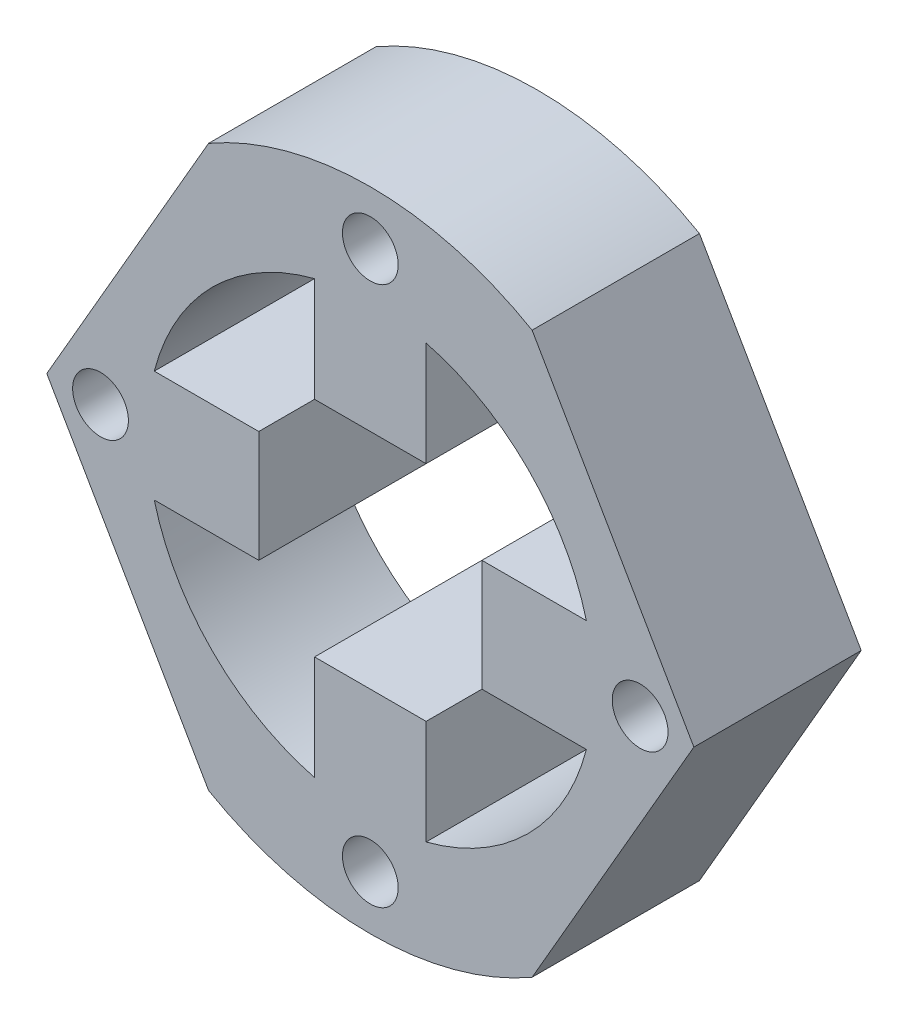
ISO-10303-21;
HEADER;
FILE_DESCRIPTION(('STEP AP214'),'2;1');
FILE_NAME('part.step','',(''),(''),'','','');
FILE_SCHEMA(('AUTOMOTIVE_DESIGN { 1 0 10303 214 1 1 1 1 }'));
ENDSEC;
DATA;
#1=APPLICATION_CONTEXT('core data for automotive mechanical design processes');
#2=APPLICATION_PROTOCOL_DEFINITION('international standard','automotive_design',2000,#1);
#3=PRODUCT_CONTEXT('',#1,'mechanical');
#4=PRODUCT('Part','Part','',(#3));
#5=PRODUCT_RELATED_PRODUCT_CATEGORY('part','',(#4));
#6=PRODUCT_DEFINITION_FORMATION('','',#4);
#7=PRODUCT_DEFINITION_CONTEXT('part definition',#1,'design');
#8=PRODUCT_DEFINITION('design','',#6,#7);
#9=PRODUCT_DEFINITION_SHAPE('','',#8);
#10=(LENGTH_UNIT() NAMED_UNIT(*) SI_UNIT(.MILLI.,.METRE.));
#11=(NAMED_UNIT(*) PLANE_ANGLE_UNIT() SI_UNIT($,.RADIAN.));
#12=(NAMED_UNIT(*) SI_UNIT($,.STERADIAN.) SOLID_ANGLE_UNIT());
#13=UNCERTAINTY_MEASURE_WITH_UNIT(LENGTH_MEASURE(1.E-05),#10,'distance_accuracy_value','');
#14=(GEOMETRIC_REPRESENTATION_CONTEXT(3) GLOBAL_UNCERTAINTY_ASSIGNED_CONTEXT((#13)) GLOBAL_UNIT_ASSIGNED_CONTEXT((#10,
#11,#12)) REPRESENTATION_CONTEXT('',''));
#15=CARTESIAN_POINT('',(0.,0.,0.));
#16=DIRECTION('',(0.,0.,1.));
#17=DIRECTION('',(1.,0.,0.));
#18=AXIS2_PLACEMENT_3D('',#15,#16,#17);
#19=CARTESIAN_POINT('',(0.,0.,-15.));
#20=DIRECTION('',(0.,0.,1.));
#21=DIRECTION('',(1.,0.,0.));
#22=AXIS2_PLACEMENT_3D('',#19,#20,#21);
#23=CYLINDRICAL_SURFACE('',#22,29.);
#24=CARTESIAN_POINT('',(0.,0.,-15.));
#25=DIRECTION('',(0.,0.,1.));
#26=DIRECTION('',(1.,0.,0.));
#27=AXIS2_PLACEMENT_3D('',#24,#25,#26);
#28=CIRCLE('',#27,29.);
#29=CARTESIAN_POINT('',(-14.5000000000003,-25.1147367097486,-15.));
#30=VERTEX_POINT('',#29);
#31=CARTESIAN_POINT('',(14.4999999999998,-25.1147367097489,-15.));
#32=VERTEX_POINT('',#31);
#33=EDGE_CURVE('E204',#30,#32,#28,.T.);
#34=ORIENTED_EDGE('',*,*,#33,.T.);
#35=DIRECTION('',(0.,0.,-1.));
#36=VECTOR('',#35,1.);
#37=CARTESIAN_POINT('',(14.4999999999998,-25.1147367097489,12.));
#38=LINE('',#37,#36);
#39=CARTESIAN_POINT('',(14.4999999999998,-25.1147367097489,0.));
#40=VERTEX_POINT('',#39);
#41=EDGE_CURVE('E187',#40,#32,#38,.T.);
#42=ORIENTED_EDGE('',*,*,#41,.F.);
#43=CARTESIAN_POINT('',(0.,0.,0.));
#44=DIRECTION('',(0.,0.,1.));
#45=DIRECTION('',(1.,0.,0.));
#46=AXIS2_PLACEMENT_3D('',#43,#44,#45);
#47=CIRCLE('',#46,29.);
#48=CARTESIAN_POINT('',(-14.5000000000003,-25.1147367097486,0.));
#49=VERTEX_POINT('',#48);
#50=EDGE_CURVE('E215',#49,#40,#47,.T.);
#51=ORIENTED_EDGE('',*,*,#50,.F.);
#52=DIRECTION('',(0.,0.,-1.));
#53=VECTOR('',#52,1.);
#54=CARTESIAN_POINT('',(-14.5000000000003,-25.1147367097486,12.));
#55=LINE('',#54,#53);
#56=EDGE_CURVE('E207',#49,#30,#55,.T.);
#57=ORIENTED_EDGE('',*,*,#56,.T.);
#58=EDGE_LOOP('',(#34,#42,#51,#57));
#59=FACE_BOUND('',#58,.T.);
#60=ADVANCED_FACE('F39',(#59),#23,.T.);
#61=CARTESIAN_POINT('',(0.,0.,-15.));
#62=DIRECTION('',(0.,0.,1.));
#63=DIRECTION('',(1.,0.,0.));
#64=AXIS2_PLACEMENT_3D('',#61,#62,#63);
#65=PLANE('',#64);
#66=CARTESIAN_POINT('',(0.,0.,-15.));
#67=DIRECTION('',(0.,0.,1.));
#68=DIRECTION('',(1.,0.,0.));
#69=AXIS2_PLACEMENT_3D('',#66,#67,#68);
#70=CIRCLE('',#69,20.);
#71=CARTESIAN_POINT('',(19.3649167310371,5.,-15.));
#72=VERTEX_POINT('',#71);
#73=CARTESIAN_POINT('',(5.,19.3649167310371,-15.));
#74=VERTEX_POINT('',#73);
#75=EDGE_CURVE('E221',#72,#74,#70,.T.);
#76=ORIENTED_EDGE('',*,*,#75,.T.);
#77=DIRECTION('',(0.,-1.,0.));
#78=VECTOR('',#77,1.);
#79=CARTESIAN_POINT('',(4.99999999999994,0.,-15.));
#80=LINE('',#79,#78);
#81=CARTESIAN_POINT('',(4.99999999999997,9.99999673103708,-15.));
#82=VERTEX_POINT('',#81);
#83=EDGE_CURVE('E320',#74,#82,#80,.T.);
#84=ORIENTED_EDGE('',*,*,#83,.T.);
#85=DIRECTION('',(1.,0.,0.));
#86=VECTOR('',#85,1.);
#87=CARTESIAN_POINT('',(0.,9.99999673103708,-15.));
#88=LINE('',#87,#86);
#89=CARTESIAN_POINT('',(-5.,9.99999673103708,-15.));
#90=VERTEX_POINT('',#89);
#91=EDGE_CURVE('E326',#90,#82,#88,.T.);
#92=ORIENTED_EDGE('',*,*,#91,.F.);
#93=DIRECTION('',(0.,-1.,0.));
#94=VECTOR('',#93,1.);
#95=CARTESIAN_POINT('',(-5.,0.,-15.));
#96=LINE('',#95,#94);
#97=CARTESIAN_POINT('',(-5.,19.3649167310371,-15.));
#98=VERTEX_POINT('',#97);
#99=EDGE_CURVE('E322',#98,#90,#96,.T.);
#100=ORIENTED_EDGE('',*,*,#99,.F.);
#101=CARTESIAN_POINT('',(-19.3649167310371,5.,-15.));
#102=VERTEX_POINT('',#101);
#103=EDGE_CURVE('E374',#98,#102,#70,.T.);
#104=ORIENTED_EDGE('',*,*,#103,.T.);
#105=DIRECTION('',(1.,0.,0.));
#106=VECTOR('',#105,1.);
#107=CARTESIAN_POINT('',(0.,5.00000000000001,-15.));
#108=LINE('',#107,#106);
#109=CARTESIAN_POINT('',(-9.99999673103708,5.,-15.));
#110=VERTEX_POINT('',#109);
#111=EDGE_CURVE('E300',#102,#110,#108,.T.);
#112=ORIENTED_EDGE('',*,*,#111,.T.);
#113=DIRECTION('',(0.,-1.,0.));
#114=VECTOR('',#113,1.);
#115=CARTESIAN_POINT('',(-9.99999673103708,0.,-15.));
#116=LINE('',#115,#114);
#117=CARTESIAN_POINT('',(-9.99999673103708,-5.,-15.));
#118=VERTEX_POINT('',#117);
#119=EDGE_CURVE('E297',#110,#118,#116,.T.);
#120=ORIENTED_EDGE('',*,*,#119,.T.);
#121=DIRECTION('',(1.,0.,0.));
#122=VECTOR('',#121,1.);
#123=CARTESIAN_POINT('',(0.,-5.,-15.));
#124=LINE('',#123,#122);
#125=CARTESIAN_POINT('',(-19.3649167310371,-5.,-15.));
#126=VERTEX_POINT('',#125);
#127=EDGE_CURVE('E294',#126,#118,#124,.T.);
#128=ORIENTED_EDGE('',*,*,#127,.F.);
#129=CARTESIAN_POINT('',(-5.,-19.3649167310371,-15.));
#130=VERTEX_POINT('',#129);
#131=EDGE_CURVE('E380',#126,#130,#70,.T.);
#132=ORIENTED_EDGE('',*,*,#131,.T.);
#133=DIRECTION('',(0.,1.,0.));
#134=VECTOR('',#133,1.);
#135=CARTESIAN_POINT('',(-5.,0.,-15.));
#136=LINE('',#135,#134);
#137=CARTESIAN_POINT('',(-5.,-9.99999673103708,-15.));
#138=VERTEX_POINT('',#137);
#139=EDGE_CURVE('E266',#130,#138,#136,.T.);
#140=ORIENTED_EDGE('',*,*,#139,.T.);
#141=DIRECTION('',(1.,0.,0.));
#142=VECTOR('',#141,1.);
#143=CARTESIAN_POINT('',(0.,-9.99999673103708,-15.));
#144=LINE('',#143,#142);
#145=CARTESIAN_POINT('',(5.,-9.99999673103708,-15.));
#146=VERTEX_POINT('',#145);
#147=EDGE_CURVE('E273',#138,#146,#144,.T.);
#148=ORIENTED_EDGE('',*,*,#147,.T.);
#149=DIRECTION('',(0.,1.,0.));
#150=VECTOR('',#149,1.);
#151=CARTESIAN_POINT('',(4.99999999999999,0.,-15.));
#152=LINE('',#151,#150);
#153=CARTESIAN_POINT('',(5.,-19.3649167310371,-15.));
#154=VERTEX_POINT('',#153);
#155=EDGE_CURVE('E269',#154,#146,#152,.T.);
#156=ORIENTED_EDGE('',*,*,#155,.F.);
#157=CARTESIAN_POINT('',(19.3649167310371,-5.,-15.));
#158=VERTEX_POINT('',#157);
#159=EDGE_CURVE('E375',#154,#158,#70,.T.);
#160=ORIENTED_EDGE('',*,*,#159,.T.);
#161=DIRECTION('',(-1.,0.,0.));
#162=VECTOR('',#161,1.);
#163=CARTESIAN_POINT('',(0.,-5.00000000000002,-15.));
#164=LINE('',#163,#162);
#165=CARTESIAN_POINT('',(9.99999673103709,-5.00000000000001,-15.));
#166=VERTEX_POINT('',#165);
#167=EDGE_CURVE('E347',#158,#166,#164,.T.);
#168=ORIENTED_EDGE('',*,*,#167,.T.);
#169=DIRECTION('',(0.,-1.,0.));
#170=VECTOR('',#169,1.);
#171=CARTESIAN_POINT('',(9.99999673103709,0.,-15.));
#172=LINE('',#171,#170);
#173=CARTESIAN_POINT('',(9.99999673103709,5.00000000000001,-15.));
#174=VERTEX_POINT('',#173);
#175=EDGE_CURVE('E353',#174,#166,#172,.T.);
#176=ORIENTED_EDGE('',*,*,#175,.F.);
#177=DIRECTION('',(-1.,0.,0.));
#178=VECTOR('',#177,1.);
#179=CARTESIAN_POINT('',(0.,5.00000000000002,-15.));
#180=LINE('',#179,#178);
#181=EDGE_CURVE('E349',#72,#174,#180,.T.);
#182=ORIENTED_EDGE('',*,*,#181,.F.);
#183=EDGE_LOOP('',(#76,#84,#92,#100,#104,#112,#120,#128,#132,#140,#148,#156,#160,#168,#176,#182));
#184=FACE_BOUND('',#183,.T.);
#185=CARTESIAN_POINT('',(-24.1824583655185,0.,-15.));
#186=DIRECTION('',(0.,0.,1.));
#187=DIRECTION('',(1.,0.,0.));
#188=AXIS2_PLACEMENT_3D('',#185,#186,#187);
#189=CIRCLE('',#188,2.5);
#190=CARTESIAN_POINT('',(-21.6824583655186,0.,-15.));
#191=VERTEX_POINT('',#190);
#192=EDGE_CURVE('E225',#191,#191,#189,.F.);
#193=ORIENTED_EDGE('',*,*,#192,.F.);
#194=EDGE_LOOP('',(#193));
#195=FACE_BOUND('',#194,.T.);
#196=CARTESIAN_POINT('',(0.,-24.1824583655185,-15.));
#197=DIRECTION('',(0.,0.,1.));
#198=DIRECTION('',(1.,0.,0.));
#199=AXIS2_PLACEMENT_3D('',#196,#197,#198);
#200=CIRCLE('',#199,2.5);
#201=CARTESIAN_POINT('',(2.5,-24.1824583655185,-15.));
#202=VERTEX_POINT('',#201);
#203=EDGE_CURVE('E230',#202,#202,#200,.F.);
#204=ORIENTED_EDGE('',*,*,#203,.F.);
#205=EDGE_LOOP('',(#204));
#206=FACE_BOUND('',#205,.T.);
#207=CARTESIAN_POINT('',(24.1824583655185,0.,-15.));
#208=DIRECTION('',(0.,0.,1.));
#209=DIRECTION('',(1.,0.,0.));
#210=AXIS2_PLACEMENT_3D('',#207,#208,#209);
#211=CIRCLE('',#210,2.5);
#212=CARTESIAN_POINT('',(26.6824583655185,0.,-15.));
#213=VERTEX_POINT('',#212);
#214=EDGE_CURVE('E234',#213,#213,#211,.F.);
#215=ORIENTED_EDGE('',*,*,#214,.F.);
#216=EDGE_LOOP('',(#215));
#217=FACE_BOUND('',#216,.T.);
#218=CARTESIAN_POINT('',(0.,24.1824583655185,-15.));
#219=DIRECTION('',(0.,0.,1.));
#220=DIRECTION('',(1.,0.,0.));
#221=AXIS2_PLACEMENT_3D('',#218,#219,#220);
#222=CIRCLE('',#221,2.5);
#223=CARTESIAN_POINT('',(2.5,24.1824583655185,-15.));
#224=VERTEX_POINT('',#223);
#225=EDGE_CURVE('E237',#224,#224,#222,.F.);
#226=ORIENTED_EDGE('',*,*,#225,.F.);
#227=EDGE_LOOP('',(#226));
#228=FACE_BOUND('',#227,.T.);
#229=DIRECTION('',(-0.500000000000007,-0.866025403784435,0.));
#230=VECTOR('',#229,1.);
#231=CARTESIAN_POINT('',(21.7499999999999,-12.5573683548745,-15.));
#232=LINE('',#231,#230);
#233=CARTESIAN_POINT('',(29.,-1.97758476261356E-13,-15.));
#234=VERTEX_POINT('',#233);
#235=EDGE_CURVE('E190',#234,#32,#232,.T.);
#236=ORIENTED_EDGE('',*,*,#235,.T.);
#237=ORIENTED_EDGE('',*,*,#33,.F.);
#238=DIRECTION('',(-0.499999999999995,0.866025403784442,0.));
#239=VECTOR('',#238,1.);
#240=CARTESIAN_POINT('',(-21.7500000000001,-12.5573683548743,-15.));
#241=LINE('',#240,#239);
#242=CARTESIAN_POINT('',(-29.,0.,-15.));
#243=VERTEX_POINT('',#242);
#244=EDGE_CURVE('E605',#30,#243,#241,.T.);
#245=ORIENTED_EDGE('',*,*,#244,.T.);
#246=DIRECTION('',(0.500000000000001,0.866025403784438,0.));
#247=VECTOR('',#246,1.);
#248=CARTESIAN_POINT('',(-21.75,12.5573683548744,-15.));
#249=LINE('',#248,#247);
#250=CARTESIAN_POINT('',(-14.4999999999999,25.1147367097488,-15.));
#251=VERTEX_POINT('',#250);
#252=EDGE_CURVE('E226',#243,#251,#249,.T.);
#253=ORIENTED_EDGE('',*,*,#252,.T.);
#254=CARTESIAN_POINT('',(14.5000000000001,25.1147367097487,-15.));
#255=VERTEX_POINT('',#254);
#256=EDGE_CURVE('E210',#255,#251,#28,.T.);
#257=ORIENTED_EDGE('',*,*,#256,.F.);
#258=DIRECTION('',(-0.499999999999995,0.866025403784442,0.));
#259=VECTOR('',#258,1.);
#260=CARTESIAN_POINT('',(21.7500000000001,12.5573683548742,-15.));
#261=LINE('',#260,#259);
#262=EDGE_CURVE('E206',#234,#255,#261,.T.);
#263=ORIENTED_EDGE('',*,*,#262,.F.);
#264=EDGE_LOOP('',(#236,#237,#245,#253,#257,#263));
#265=FACE_BOUND('',#264,.T.);
#266=ADVANCED_FACE('F202',(#184,#195,#206,#217,#228,#265),#65,.F.);
#267=CARTESIAN_POINT('',(0.,0.,0.));
#268=DIRECTION('',(0.,0.,1.));
#269=DIRECTION('',(1.,0.,0.));
#270=AXIS2_PLACEMENT_3D('',#267,#268,#269);
#271=PLANE('',#270);
#272=CARTESIAN_POINT('',(0.,24.1824583655185,0.));
#273=DIRECTION('',(0.,0.,1.));
#274=DIRECTION('',(1.,0.,0.));
#275=AXIS2_PLACEMENT_3D('',#272,#273,#274);
#276=CIRCLE('',#275,2.5);
#277=CARTESIAN_POINT('',(2.5,24.1824583655185,0.));
#278=VERTEX_POINT('',#277);
#279=EDGE_CURVE('E235',#278,#278,#276,.F.);
#280=ORIENTED_EDGE('',*,*,#279,.T.);
#281=EDGE_LOOP('',(#280));
#282=FACE_BOUND('',#281,.T.);
#283=CARTESIAN_POINT('',(24.1824583655185,0.,0.));
#284=DIRECTION('',(0.,0.,1.));
#285=DIRECTION('',(1.,0.,0.));
#286=AXIS2_PLACEMENT_3D('',#283,#284,#285);
#287=CIRCLE('',#286,2.5);
#288=CARTESIAN_POINT('',(26.6824583655185,0.,0.));
#289=VERTEX_POINT('',#288);
#290=EDGE_CURVE('E231',#289,#289,#287,.F.);
#291=ORIENTED_EDGE('',*,*,#290,.T.);
#292=EDGE_LOOP('',(#291));
#293=FACE_BOUND('',#292,.T.);
#294=CARTESIAN_POINT('',(0.,-24.1824583655185,0.));
#295=DIRECTION('',(0.,0.,1.));
#296=DIRECTION('',(1.,0.,0.));
#297=AXIS2_PLACEMENT_3D('',#294,#295,#296);
#298=CIRCLE('',#297,2.5);
#299=CARTESIAN_POINT('',(2.5,-24.1824583655185,0.));
#300=VERTEX_POINT('',#299);
#301=EDGE_CURVE('E227',#300,#300,#298,.F.);
#302=ORIENTED_EDGE('',*,*,#301,.T.);
#303=EDGE_LOOP('',(#302));
#304=FACE_BOUND('',#303,.T.);
#305=CARTESIAN_POINT('',(-24.1824583655185,0.,0.));
#306=DIRECTION('',(0.,0.,1.));
#307=DIRECTION('',(1.,0.,0.));
#308=AXIS2_PLACEMENT_3D('',#305,#306,#307);
#309=CIRCLE('',#308,2.5);
#310=CARTESIAN_POINT('',(-21.6824583655186,0.,0.));
#311=VERTEX_POINT('',#310);
#312=EDGE_CURVE('E222',#311,#311,#309,.F.);
#313=ORIENTED_EDGE('',*,*,#312,.T.);
#314=EDGE_LOOP('',(#313));
#315=FACE_BOUND('',#314,.T.);
#316=CARTESIAN_POINT('',(0.,0.,0.));
#317=DIRECTION('',(0.,0.,1.));
#318=DIRECTION('',(1.,0.,0.));
#319=AXIS2_PLACEMENT_3D('',#316,#317,#318);
#320=CIRCLE('',#319,20.);
#321=CARTESIAN_POINT('',(19.3649167310371,5.,0.));
#322=VERTEX_POINT('',#321);
#323=CARTESIAN_POINT('',(5.,19.3649167310371,0.));
#324=VERTEX_POINT('',#323);
#325=EDGE_CURVE('E218',#322,#324,#320,.T.);
#326=ORIENTED_EDGE('',*,*,#325,.F.);
#327=DIRECTION('',(-1.,0.,0.));
#328=VECTOR('',#327,1.);
#329=CARTESIAN_POINT('',(0.,5.00000000000002,0.));
#330=LINE('',#329,#328);
#331=CARTESIAN_POINT('',(9.99999673103709,5.00000000000001,0.));
#332=VERTEX_POINT('',#331);
#333=EDGE_CURVE('E359',#322,#332,#330,.T.);
#334=ORIENTED_EDGE('',*,*,#333,.T.);
#335=DIRECTION('',(0.,-1.,0.));
#336=VECTOR('',#335,1.);
#337=CARTESIAN_POINT('',(9.99999673103709,0.,0.));
#338=LINE('',#337,#336);
#339=CARTESIAN_POINT('',(9.99999673103709,-5.00000000000001,0.));
#340=VERTEX_POINT('',#339);
#341=EDGE_CURVE('E350',#332,#340,#338,.T.);
#342=ORIENTED_EDGE('',*,*,#341,.T.);
#343=DIRECTION('',(-1.,0.,0.));
#344=VECTOR('',#343,1.);
#345=CARTESIAN_POINT('',(0.,-5.00000000000002,0.));
#346=LINE('',#345,#344);
#347=CARTESIAN_POINT('',(19.3649167310371,-5.,0.));
#348=VERTEX_POINT('',#347);
#349=EDGE_CURVE('E339',#348,#340,#346,.T.);
#350=ORIENTED_EDGE('',*,*,#349,.F.);
#351=CARTESIAN_POINT('',(5.,-19.3649167310371,0.));
#352=VERTEX_POINT('',#351);
#353=EDGE_CURVE('E366',#352,#348,#320,.T.);
#354=ORIENTED_EDGE('',*,*,#353,.F.);
#355=DIRECTION('',(0.,1.,0.));
#356=VECTOR('',#355,1.);
#357=CARTESIAN_POINT('',(4.99999999999999,0.,0.));
#358=LINE('',#357,#356);
#359=CARTESIAN_POINT('',(5.,-9.99999673103708,0.));
#360=VERTEX_POINT('',#359);
#361=EDGE_CURVE('E278',#352,#360,#358,.T.);
#362=ORIENTED_EDGE('',*,*,#361,.T.);
#363=DIRECTION('',(1.,0.,0.));
#364=VECTOR('',#363,1.);
#365=CARTESIAN_POINT('',(0.,-9.99999673103708,0.));
#366=LINE('',#365,#364);
#367=CARTESIAN_POINT('',(-5.,-9.99999673103708,0.));
#368=VERTEX_POINT('',#367);
#369=EDGE_CURVE('E270',#368,#360,#366,.T.);
#370=ORIENTED_EDGE('',*,*,#369,.F.);
#371=DIRECTION('',(0.,1.,0.));
#372=VECTOR('',#371,1.);
#373=CARTESIAN_POINT('',(-5.,0.,0.));
#374=LINE('',#373,#372);
#375=CARTESIAN_POINT('',(-5.,-19.3649167310371,0.));
#376=VERTEX_POINT('',#375);
#377=EDGE_CURVE('E265',#376,#368,#374,.T.);
#378=ORIENTED_EDGE('',*,*,#377,.F.);
#379=CARTESIAN_POINT('',(-19.3649167310371,-5.,0.));
#380=VERTEX_POINT('',#379);
#381=EDGE_CURVE('E386',#380,#376,#320,.T.);
#382=ORIENTED_EDGE('',*,*,#381,.F.);
#383=DIRECTION('',(1.,0.,0.));
#384=VECTOR('',#383,1.);
#385=CARTESIAN_POINT('',(0.,-5.,0.));
#386=LINE('',#385,#384);
#387=CARTESIAN_POINT('',(-9.99999673103708,-5.,0.));
#388=VERTEX_POINT('',#387);
#389=EDGE_CURVE('E286',#380,#388,#386,.T.);
#390=ORIENTED_EDGE('',*,*,#389,.T.);
#391=DIRECTION('',(0.,-1.,0.));
#392=VECTOR('',#391,1.);
#393=CARTESIAN_POINT('',(-9.99999673103708,0.,0.));
#394=LINE('',#393,#392);
#395=CARTESIAN_POINT('',(-9.99999673103708,5.,0.));
#396=VERTEX_POINT('',#395);
#397=EDGE_CURVE('E305',#396,#388,#394,.T.);
#398=ORIENTED_EDGE('',*,*,#397,.F.);
#399=DIRECTION('',(1.,0.,0.));
#400=VECTOR('',#399,1.);
#401=CARTESIAN_POINT('',(0.,5.00000000000001,0.));
#402=LINE('',#401,#400);
#403=CARTESIAN_POINT('',(-19.3649167310371,5.,0.));
#404=VERTEX_POINT('',#403);
#405=EDGE_CURVE('E298',#404,#396,#402,.T.);
#406=ORIENTED_EDGE('',*,*,#405,.F.);
#407=CARTESIAN_POINT('',(-5.,19.3649167310371,0.));
#408=VERTEX_POINT('',#407);
#409=EDGE_CURVE('E384',#408,#404,#320,.T.);
#410=ORIENTED_EDGE('',*,*,#409,.F.);
#411=DIRECTION('',(0.,-1.,0.));
#412=VECTOR('',#411,1.);
#413=CARTESIAN_POINT('',(-5.,0.,0.));
#414=LINE('',#413,#412);
#415=CARTESIAN_POINT('',(-5.,9.99999673103708,0.));
#416=VERTEX_POINT('',#415);
#417=EDGE_CURVE('E332',#408,#416,#414,.T.);
#418=ORIENTED_EDGE('',*,*,#417,.T.);
#419=DIRECTION('',(1.,0.,0.));
#420=VECTOR('',#419,1.);
#421=CARTESIAN_POINT('',(0.,9.99999673103708,0.));
#422=LINE('',#421,#420);
#423=CARTESIAN_POINT('',(4.99999999999997,9.99999673103708,0.));
#424=VERTEX_POINT('',#423);
#425=EDGE_CURVE('E323',#416,#424,#422,.T.);
#426=ORIENTED_EDGE('',*,*,#425,.T.);
#427=DIRECTION('',(0.,-1.,0.));
#428=VECTOR('',#427,1.);
#429=CARTESIAN_POINT('',(4.99999999999994,0.,0.));
#430=LINE('',#429,#428);
#431=EDGE_CURVE('E312',#324,#424,#430,.T.);
#432=ORIENTED_EDGE('',*,*,#431,.F.);
#433=EDGE_LOOP('',(#326,#334,#342,#350,#354,#362,#370,#378,#382,#390,#398,#406,#410,#418,#426,#432));
#434=FACE_BOUND('',#433,.T.);
#435=ORIENTED_EDGE('',*,*,#50,.T.);
#436=DIRECTION('',(0.500000000000007,0.866025403784435,0.));
#437=VECTOR('',#436,1.);
#438=CARTESIAN_POINT('',(21.7499999999999,-12.5573683548745,0.));
#439=LINE('',#438,#437);
#440=CARTESIAN_POINT('',(29.,-1.97758476261356E-13,0.));
#441=VERTEX_POINT('',#440);
#442=EDGE_CURVE('E193',#40,#441,#439,.T.);
#443=ORIENTED_EDGE('',*,*,#442,.T.);
#444=DIRECTION('',(-0.499999999999995,0.866025403784442,0.));
#445=VECTOR('',#444,1.);
#446=CARTESIAN_POINT('',(21.7500000000001,12.5573683548742,0.));
#447=LINE('',#446,#445);
#448=CARTESIAN_POINT('',(14.5000000000001,25.1147367097487,0.));
#449=VERTEX_POINT('',#448);
#450=EDGE_CURVE('E47',#441,#449,#447,.T.);
#451=ORIENTED_EDGE('',*,*,#450,.T.);
#452=CARTESIAN_POINT('',(-14.4999999999999,25.1147367097488,0.));
#453=VERTEX_POINT('',#452);
#454=EDGE_CURVE('E211',#449,#453,#47,.T.);
#455=ORIENTED_EDGE('',*,*,#454,.T.);
#456=DIRECTION('',(0.500000000000001,0.866025403784438,0.));
#457=VECTOR('',#456,1.);
#458=CARTESIAN_POINT('',(-21.75,12.5573683548744,0.));
#459=LINE('',#458,#457);
#460=CARTESIAN_POINT('',(-29.,0.,0.));
#461=VERTEX_POINT('',#460);
#462=EDGE_CURVE('E11',#461,#453,#459,.T.);
#463=ORIENTED_EDGE('',*,*,#462,.F.);
#464=DIRECTION('',(0.499999999999995,-0.866025403784441,0.));
#465=VECTOR('',#464,1.);
#466=CARTESIAN_POINT('',(-21.7500000000001,-12.5573683548743,0.));
#467=LINE('',#466,#465);
#468=EDGE_CURVE('E54',#461,#49,#467,.T.);
#469=ORIENTED_EDGE('',*,*,#468,.T.);
#470=EDGE_LOOP('',(#435,#443,#451,#455,#463,#469));
#471=FACE_BOUND('',#470,.T.);
#472=ADVANCED_FACE('F240',(#282,#293,#304,#315,#434,#471),#271,.T.);
#473=DIRECTION('',(0.,0.,1.));
#474=VECTOR('',#473,1.);
#475=CARTESIAN_POINT('',(-14.4999999999999,25.1147367097488,-31.));
#476=LINE('',#475,#474);
#477=EDGE_CURVE('E244',#251,#453,#476,.T.);
#478=ORIENTED_EDGE('',*,*,#477,.T.);
#479=ORIENTED_EDGE('',*,*,#454,.F.);
#480=DIRECTION('',(0.,0.,-1.));
#481=VECTOR('',#480,1.);
#482=CARTESIAN_POINT('',(14.5000000000001,25.1147367097487,12.));
#483=LINE('',#482,#481);
#484=EDGE_CURVE('E62',#449,#255,#483,.T.);
#485=ORIENTED_EDGE('',*,*,#484,.T.);
#486=ORIENTED_EDGE('',*,*,#256,.T.);
#487=EDGE_LOOP('',(#478,#479,#485,#486));
#488=FACE_BOUND('',#487,.T.);
#489=ADVANCED_FACE('F41',(#488),#23,.T.);
#490=CARTESIAN_POINT('',(0.,0.,-15.));
#491=DIRECTION('',(0.,0.,1.));
#492=DIRECTION('',(1.,0.,0.));
#493=AXIS2_PLACEMENT_3D('',#490,#491,#492);
#494=CYLINDRICAL_SURFACE('',#493,20.);
#495=DIRECTION('',(0.,0.,1.));
#496=VECTOR('',#495,1.);
#497=CARTESIAN_POINT('',(-5.,-19.3649167310371,-15.));
#498=LINE('',#497,#496);
#499=EDGE_CURVE('E275',#130,#376,#498,.T.);
#500=ORIENTED_EDGE('',*,*,#499,.F.);
#501=ORIENTED_EDGE('',*,*,#131,.F.);
#502=DIRECTION('',(0.,0.,1.));
#503=VECTOR('',#502,1.);
#504=CARTESIAN_POINT('',(-19.3649167310371,-5.,-15.));
#505=LINE('',#504,#503);
#506=EDGE_CURVE('E302',#126,#380,#505,.T.);
#507=ORIENTED_EDGE('',*,*,#506,.T.);
#508=ORIENTED_EDGE('',*,*,#381,.T.);
#509=EDGE_LOOP('',(#500,#501,#507,#508));
#510=FACE_BOUND('',#509,.T.);
#511=ADVANCED_FACE('F389',(#510),#494,.F.);
#512=DIRECTION('',(0.,0.,1.));
#513=VECTOR('',#512,1.);
#514=CARTESIAN_POINT('',(-19.3649167310371,5.,-15.));
#515=LINE('',#514,#513);
#516=EDGE_CURVE('E309',#102,#404,#515,.T.);
#517=ORIENTED_EDGE('',*,*,#516,.F.);
#518=ORIENTED_EDGE('',*,*,#103,.F.);
#519=DIRECTION('',(0.,0.,1.));
#520=VECTOR('',#519,1.);
#521=CARTESIAN_POINT('',(-5.,19.3649167310371,-15.));
#522=LINE('',#521,#520);
#523=EDGE_CURVE('E342',#98,#408,#522,.T.);
#524=ORIENTED_EDGE('',*,*,#523,.T.);
#525=ORIENTED_EDGE('',*,*,#409,.T.);
#526=EDGE_LOOP('',(#517,#518,#524,#525));
#527=FACE_BOUND('',#526,.T.);
#528=ADVANCED_FACE('F417',(#527),#494,.F.);
#529=DIRECTION('',(0.,0.,1.));
#530=VECTOR('',#529,1.);
#531=CARTESIAN_POINT('',(5.,19.3649167310371,-15.));
#532=LINE('',#531,#530);
#533=EDGE_CURVE('E329',#74,#324,#532,.T.);
#534=ORIENTED_EDGE('',*,*,#533,.F.);
#535=ORIENTED_EDGE('',*,*,#75,.F.);
#536=DIRECTION('',(0.,0.,1.));
#537=VECTOR('',#536,1.);
#538=CARTESIAN_POINT('',(19.3649167310371,5.,-15.));
#539=LINE('',#538,#537);
#540=EDGE_CURVE('E369',#72,#322,#539,.T.);
#541=ORIENTED_EDGE('',*,*,#540,.T.);
#542=ORIENTED_EDGE('',*,*,#325,.T.);
#543=EDGE_LOOP('',(#534,#535,#541,#542));
#544=FACE_BOUND('',#543,.T.);
#545=ADVANCED_FACE('F434',(#544),#494,.F.);
#546=ORIENTED_EDGE('',*,*,#159,.F.);
#547=DIRECTION('',(0.,0.,1.));
#548=VECTOR('',#547,1.);
#549=CARTESIAN_POINT('',(5.,-19.3649167310371,-15.));
#550=LINE('',#549,#548);
#551=EDGE_CURVE('E289',#154,#352,#550,.T.);
#552=ORIENTED_EDGE('',*,*,#551,.T.);
#553=ORIENTED_EDGE('',*,*,#353,.T.);
#554=DIRECTION('',(0.,0.,1.));
#555=VECTOR('',#554,1.);
#556=CARTESIAN_POINT('',(19.3649167310371,-5.,-15.));
#557=LINE('',#556,#555);
#558=EDGE_CURVE('E356',#158,#348,#557,.T.);
#559=ORIENTED_EDGE('',*,*,#558,.F.);
#560=EDGE_LOOP('',(#546,#552,#553,#559));
#561=FACE_BOUND('',#560,.T.);
#562=ADVANCED_FACE('F445',(#561),#494,.F.);
#563=CARTESIAN_POINT('',(0.,-5.00000000000002,-15.));
#564=DIRECTION('',(0.,1.,0.));
#565=DIRECTION('',(-1.,0.,0.));
#566=AXIS2_PLACEMENT_3D('',#563,#564,#565);
#567=PLANE('',#566);
#568=ORIENTED_EDGE('',*,*,#349,.T.);
#569=DIRECTION('',(0.,0.,1.));
#570=VECTOR('',#569,1.);
#571=CARTESIAN_POINT('',(9.99999673103709,-5.00000000000001,-15.));
#572=LINE('',#571,#570);
#573=EDGE_CURVE('E364',#166,#340,#572,.T.);
#574=ORIENTED_EDGE('',*,*,#573,.F.);
#575=ORIENTED_EDGE('',*,*,#167,.F.);
#576=ORIENTED_EDGE('',*,*,#558,.T.);
#577=EDGE_LOOP('',(#568,#574,#575,#576));
#578=FACE_BOUND('',#577,.T.);
#579=ADVANCED_FACE('F443',(#578),#567,.F.);
#580=CARTESIAN_POINT('',(9.99999673103709,0.,-15.));
#581=DIRECTION('',(-1.,0.,0.));
#582=DIRECTION('',(0.,-1.,0.));
#583=AXIS2_PLACEMENT_3D('',#580,#581,#582);
#584=PLANE('',#583);
#585=ORIENTED_EDGE('',*,*,#341,.F.);
#586=DIRECTION('',(0.,0.,1.));
#587=VECTOR('',#586,1.);
#588=CARTESIAN_POINT('',(9.99999673103709,5.00000000000001,-15.));
#589=LINE('',#588,#587);
#590=EDGE_CURVE('E367',#174,#332,#589,.T.);
#591=ORIENTED_EDGE('',*,*,#590,.F.);
#592=ORIENTED_EDGE('',*,*,#175,.T.);
#593=ORIENTED_EDGE('',*,*,#573,.T.);
#594=EDGE_LOOP('',(#585,#591,#592,#593));
#595=FACE_BOUND('',#594,.T.);
#596=ADVANCED_FACE('F439',(#595),#584,.T.);
#597=CARTESIAN_POINT('',(0.,5.00000000000002,-15.));
#598=DIRECTION('',(0.,1.,0.));
#599=DIRECTION('',(-1.,0.,0.));
#600=AXIS2_PLACEMENT_3D('',#597,#598,#599);
#601=PLANE('',#600);
#602=ORIENTED_EDGE('',*,*,#333,.F.);
#603=ORIENTED_EDGE('',*,*,#540,.F.);
#604=ORIENTED_EDGE('',*,*,#181,.T.);
#605=ORIENTED_EDGE('',*,*,#590,.T.);
#606=EDGE_LOOP('',(#602,#603,#604,#605));
#607=FACE_BOUND('',#606,.T.);
#608=ADVANCED_FACE('F436',(#607),#601,.T.);
#609=CARTESIAN_POINT('',(4.99999999999994,0.,-15.));
#610=DIRECTION('',(-1.,0.,0.));
#611=DIRECTION('',(0.,-1.,0.));
#612=AXIS2_PLACEMENT_3D('',#609,#610,#611);
#613=PLANE('',#612);
#614=ORIENTED_EDGE('',*,*,#431,.T.);
#615=DIRECTION('',(0.,0.,1.));
#616=VECTOR('',#615,1.);
#617=CARTESIAN_POINT('',(4.99999999999997,9.99999673103708,-15.));
#618=LINE('',#617,#616);
#619=EDGE_CURVE('E337',#82,#424,#618,.T.);
#620=ORIENTED_EDGE('',*,*,#619,.F.);
#621=ORIENTED_EDGE('',*,*,#83,.F.);
#622=ORIENTED_EDGE('',*,*,#533,.T.);
#623=EDGE_LOOP('',(#614,#620,#621,#622));
#624=FACE_BOUND('',#623,.T.);
#625=ADVANCED_FACE('F430',(#624),#613,.F.);
#626=CARTESIAN_POINT('',(0.,9.99999673103708,-15.));
#627=DIRECTION('',(0.,-1.,0.));
#628=DIRECTION('',(0.,0.,-1.));
#629=AXIS2_PLACEMENT_3D('',#626,#627,#628);
#630=PLANE('',#629);
#631=ORIENTED_EDGE('',*,*,#425,.F.);
#632=DIRECTION('',(0.,0.,1.));
#633=VECTOR('',#632,1.);
#634=CARTESIAN_POINT('',(-5.,9.99999673103708,-15.));
#635=LINE('',#634,#633);
#636=EDGE_CURVE('E340',#90,#416,#635,.T.);
#637=ORIENTED_EDGE('',*,*,#636,.F.);
#638=ORIENTED_EDGE('',*,*,#91,.T.);
#639=ORIENTED_EDGE('',*,*,#619,.T.);
#640=EDGE_LOOP('',(#631,#637,#638,#639));
#641=FACE_BOUND('',#640,.T.);
#642=ADVANCED_FACE('F427',(#641),#630,.T.);
#643=CARTESIAN_POINT('',(-5.,0.,-15.));
#644=DIRECTION('',(-1.,0.,0.));
#645=DIRECTION('',(0.,-1.,0.));
#646=AXIS2_PLACEMENT_3D('',#643,#644,#645);
#647=PLANE('',#646);
#648=ORIENTED_EDGE('',*,*,#417,.F.);
#649=ORIENTED_EDGE('',*,*,#523,.F.);
#650=ORIENTED_EDGE('',*,*,#99,.T.);
#651=ORIENTED_EDGE('',*,*,#636,.T.);
#652=EDGE_LOOP('',(#648,#649,#650,#651));
#653=FACE_BOUND('',#652,.T.);
#654=ADVANCED_FACE('F423',(#653),#647,.T.);
#655=CARTESIAN_POINT('',(0.,5.00000000000001,-15.));
#656=DIRECTION('',(0.,-1.,0.));
#657=DIRECTION('',(1.,0.,0.));
#658=AXIS2_PLACEMENT_3D('',#655,#656,#657);
#659=PLANE('',#658);
#660=ORIENTED_EDGE('',*,*,#405,.T.);
#661=DIRECTION('',(0.,0.,1.));
#662=VECTOR('',#661,1.);
#663=CARTESIAN_POINT('',(-9.99999673103708,5.,-15.));
#664=LINE('',#663,#662);
#665=EDGE_CURVE('E313',#110,#396,#664,.T.);
#666=ORIENTED_EDGE('',*,*,#665,.F.);
#667=ORIENTED_EDGE('',*,*,#111,.F.);
#668=ORIENTED_EDGE('',*,*,#516,.T.);
#669=EDGE_LOOP('',(#660,#666,#667,#668));
#670=FACE_BOUND('',#669,.T.);
#671=ADVANCED_FACE('F415',(#670),#659,.F.);
#672=CARTESIAN_POINT('',(-9.99999673103708,0.,-15.));
#673=DIRECTION('',(-1.,0.,0.));
#674=DIRECTION('',(0.,-1.,0.));
#675=AXIS2_PLACEMENT_3D('',#672,#673,#674);
#676=PLANE('',#675);
#677=ORIENTED_EDGE('',*,*,#397,.T.);
#678=DIRECTION('',(0.,0.,1.));
#679=VECTOR('',#678,1.);
#680=CARTESIAN_POINT('',(-9.99999673103708,-5.,-15.));
#681=LINE('',#680,#679);
#682=EDGE_CURVE('E316',#118,#388,#681,.T.);
#683=ORIENTED_EDGE('',*,*,#682,.F.);
#684=ORIENTED_EDGE('',*,*,#119,.F.);
#685=ORIENTED_EDGE('',*,*,#665,.T.);
#686=EDGE_LOOP('',(#677,#683,#684,#685));
#687=FACE_BOUND('',#686,.T.);
#688=ADVANCED_FACE('F410',(#687),#676,.F.);
#689=CARTESIAN_POINT('',(0.,-5.,-15.));
#690=DIRECTION('',(0.,-1.,0.));
#691=DIRECTION('',(1.,0.,0.));
#692=AXIS2_PLACEMENT_3D('',#689,#690,#691);
#693=PLANE('',#692);
#694=ORIENTED_EDGE('',*,*,#389,.F.);
#695=ORIENTED_EDGE('',*,*,#506,.F.);
#696=ORIENTED_EDGE('',*,*,#127,.T.);
#697=ORIENTED_EDGE('',*,*,#682,.T.);
#698=EDGE_LOOP('',(#694,#695,#696,#697));
#699=FACE_BOUND('',#698,.T.);
#700=ADVANCED_FACE('F405',(#699),#693,.T.);
#701=CARTESIAN_POINT('',(-5.,0.,-15.));
#702=DIRECTION('',(1.,0.,0.));
#703=DIRECTION('',(0.,1.,0.));
#704=AXIS2_PLACEMENT_3D('',#701,#702,#703);
#705=PLANE('',#704);
#706=ORIENTED_EDGE('',*,*,#377,.T.);
#707=DIRECTION('',(0.,0.,1.));
#708=VECTOR('',#707,1.);
#709=CARTESIAN_POINT('',(-5.,-9.99999673103708,-15.));
#710=LINE('',#709,#708);
#711=EDGE_CURVE('E283',#138,#368,#710,.T.);
#712=ORIENTED_EDGE('',*,*,#711,.F.);
#713=ORIENTED_EDGE('',*,*,#139,.F.);
#714=ORIENTED_EDGE('',*,*,#499,.T.);
#715=EDGE_LOOP('',(#706,#712,#713,#714));
#716=FACE_BOUND('',#715,.T.);
#717=ADVANCED_FACE('F396',(#716),#705,.F.);
#718=CARTESIAN_POINT('',(0.,-9.99999673103708,-15.));
#719=DIRECTION('',(0.,-1.,0.));
#720=DIRECTION('',(0.,0.,-1.));
#721=AXIS2_PLACEMENT_3D('',#718,#719,#720);
#722=PLANE('',#721);
#723=ORIENTED_EDGE('',*,*,#369,.T.);
#724=DIRECTION('',(0.,0.,1.));
#725=VECTOR('',#724,1.);
#726=CARTESIAN_POINT('',(5.,-9.99999673103708,-15.));
#727=LINE('',#726,#725);
#728=EDGE_CURVE('E287',#146,#360,#727,.T.);
#729=ORIENTED_EDGE('',*,*,#728,.F.);
#730=ORIENTED_EDGE('',*,*,#147,.F.);
#731=ORIENTED_EDGE('',*,*,#711,.T.);
#732=EDGE_LOOP('',(#723,#729,#730,#731));
#733=FACE_BOUND('',#732,.T.);
#734=ADVANCED_FACE('F401',(#733),#722,.F.);
#735=CARTESIAN_POINT('',(4.99999999999999,0.,-15.));
#736=DIRECTION('',(1.,0.,0.));
#737=DIRECTION('',(0.,1.,0.));
#738=AXIS2_PLACEMENT_3D('',#735,#736,#737);
#739=PLANE('',#738);
#740=ORIENTED_EDGE('',*,*,#361,.F.);
#741=ORIENTED_EDGE('',*,*,#551,.F.);
#742=ORIENTED_EDGE('',*,*,#155,.T.);
#743=ORIENTED_EDGE('',*,*,#728,.T.);
#744=EDGE_LOOP('',(#740,#741,#742,#743));
#745=FACE_BOUND('',#744,.T.);
#746=ADVANCED_FACE('F448',(#745),#739,.T.);
#747=CARTESIAN_POINT('',(-24.1824583655185,0.,38.));
#748=DIRECTION('',(0.,0.,-1.));
#749=DIRECTION('',(-1.,0.,0.));
#750=AXIS2_PLACEMENT_3D('',#747,#748,#749);
#751=CYLINDRICAL_SURFACE('',#750,2.5);
#752=ORIENTED_EDGE('',*,*,#312,.F.);
#753=EDGE_LOOP('',(#752));
#754=FACE_BOUND('',#753,.T.);
#755=ORIENTED_EDGE('',*,*,#192,.T.);
#756=EDGE_LOOP('',(#755));
#757=FACE_BOUND('',#756,.T.);
#758=ADVANCED_FACE('F450',(#754,#757),#751,.F.);
#759=CARTESIAN_POINT('',(0.,-24.1824583655185,38.));
#760=DIRECTION('',(0.,0.,-1.));
#761=DIRECTION('',(-1.,0.,0.));
#762=AXIS2_PLACEMENT_3D('',#759,#760,#761);
#763=CYLINDRICAL_SURFACE('',#762,2.5);
#764=ORIENTED_EDGE('',*,*,#301,.F.);
#765=EDGE_LOOP('',(#764));
#766=FACE_BOUND('',#765,.T.);
#767=ORIENTED_EDGE('',*,*,#203,.T.);
#768=EDGE_LOOP('',(#767));
#769=FACE_BOUND('',#768,.T.);
#770=ADVANCED_FACE('F456',(#766,#769),#763,.F.);
#771=CARTESIAN_POINT('',(24.1824583655185,0.,38.));
#772=DIRECTION('',(0.,0.,-1.));
#773=DIRECTION('',(-1.,0.,0.));
#774=AXIS2_PLACEMENT_3D('',#771,#772,#773);
#775=CYLINDRICAL_SURFACE('',#774,2.5);
#776=ORIENTED_EDGE('',*,*,#290,.F.);
#777=EDGE_LOOP('',(#776));
#778=FACE_BOUND('',#777,.T.);
#779=ORIENTED_EDGE('',*,*,#214,.T.);
#780=EDGE_LOOP('',(#779));
#781=FACE_BOUND('',#780,.T.);
#782=ADVANCED_FACE('F523',(#778,#781),#775,.F.);
#783=CARTESIAN_POINT('',(0.,24.1824583655185,38.));
#784=DIRECTION('',(0.,0.,-1.));
#785=DIRECTION('',(-1.,0.,0.));
#786=AXIS2_PLACEMENT_3D('',#783,#784,#785);
#787=CYLINDRICAL_SURFACE('',#786,2.5);
#788=ORIENTED_EDGE('',*,*,#279,.F.);
#789=EDGE_LOOP('',(#788));
#790=FACE_BOUND('',#789,.T.);
#791=ORIENTED_EDGE('',*,*,#225,.T.);
#792=EDGE_LOOP('',(#791));
#793=FACE_BOUND('',#792,.T.);
#794=ADVANCED_FACE('F533',(#790,#793),#787,.F.);
#795=CARTESIAN_POINT('',(21.7500000000001,12.5573683548742,12.));
#796=DIRECTION('',(0.866025403784441,0.499999999999995,0.));
#797=DIRECTION('',(-0.499999999999995,0.866025403784442,0.));
#798=AXIS2_PLACEMENT_3D('',#795,#796,#797);
#799=PLANE('',#798);
#800=ORIENTED_EDGE('',*,*,#262,.T.);
#801=ORIENTED_EDGE('',*,*,#484,.F.);
#802=ORIENTED_EDGE('',*,*,#450,.F.);
#803=DIRECTION('',(0.,0.,-1.));
#804=VECTOR('',#803,1.);
#805=CARTESIAN_POINT('',(29.,-1.97758476261356E-13,12.));
#806=LINE('',#805,#804);
#807=EDGE_CURVE('E249',#441,#234,#806,.T.);
#808=ORIENTED_EDGE('',*,*,#807,.T.);
#809=EDGE_LOOP('',(#800,#801,#802,#808));
#810=FACE_BOUND('',#809,.T.);
#811=ADVANCED_FACE('F542',(#810),#799,.T.);
#812=CARTESIAN_POINT('',(-21.75,12.5573683548744,-31.));
#813=DIRECTION('',(0.866025403784438,-0.500000000000001,0.));
#814=DIRECTION('',(0.500000000000001,0.866025403784438,0.));
#815=AXIS2_PLACEMENT_3D('',#812,#813,#814);
#816=PLANE('',#815);
#817=DIRECTION('',(0.,0.,1.));
#818=VECTOR('',#817,1.);
#819=CARTESIAN_POINT('',(-29.,0.,-31.));
#820=LINE('',#819,#818);
#821=EDGE_CURVE('E248',#243,#461,#820,.T.);
#822=ORIENTED_EDGE('',*,*,#821,.T.);
#823=ORIENTED_EDGE('',*,*,#462,.T.);
#824=ORIENTED_EDGE('',*,*,#477,.F.);
#825=ORIENTED_EDGE('',*,*,#252,.F.);
#826=EDGE_LOOP('',(#822,#823,#824,#825));
#827=FACE_BOUND('',#826,.T.);
#828=ADVANCED_FACE('F576',(#827),#816,.F.);
#829=CARTESIAN_POINT('',(-21.7500000000001,-12.5573683548743,12.));
#830=DIRECTION('',(-0.866025403784441,-0.499999999999995,0.));
#831=DIRECTION('',(0.499999999999995,-0.866025403784441,0.));
#832=AXIS2_PLACEMENT_3D('',#829,#830,#831);
#833=PLANE('',#832);
#834=ORIENTED_EDGE('',*,*,#821,.F.);
#835=ORIENTED_EDGE('',*,*,#244,.F.);
#836=ORIENTED_EDGE('',*,*,#56,.F.);
#837=ORIENTED_EDGE('',*,*,#468,.F.);
#838=EDGE_LOOP('',(#834,#835,#836,#837));
#839=FACE_BOUND('',#838,.T.);
#840=ADVANCED_FACE('F585',(#839),#833,.T.);
#841=CARTESIAN_POINT('',(21.7499999999999,-12.5573683548745,12.));
#842=DIRECTION('',(0.866025403784434,-0.500000000000007,0.));
#843=DIRECTION('',(0.500000000000007,0.866025403784435,0.));
#844=AXIS2_PLACEMENT_3D('',#841,#842,#843);
#845=PLANE('',#844);
#846=ORIENTED_EDGE('',*,*,#41,.T.);
#847=ORIENTED_EDGE('',*,*,#235,.F.);
#848=ORIENTED_EDGE('',*,*,#807,.F.);
#849=ORIENTED_EDGE('',*,*,#442,.F.);
#850=EDGE_LOOP('',(#846,#847,#848,#849));
#851=FACE_BOUND('',#850,.T.);
#852=ADVANCED_FACE('F189',(#851),#845,.T.);
#853=CLOSED_SHELL('',(#60,#266,#472,#489,#511,#528,#545,#562,#579,#596,#608,#625,#642,#654,#671,
#688,#700,#717,#734,#746,#758,#770,#782,#794,#811,#828,#840,#852));
#854=MANIFOLD_SOLID_BREP('B2',#853);
#855=ADVANCED_BREP_SHAPE_REPRESENTATION('',(#18,#854),#14);
#856=SHAPE_DEFINITION_REPRESENTATION(#9,#855);
ENDSEC;
END-ISO-10303-21;
